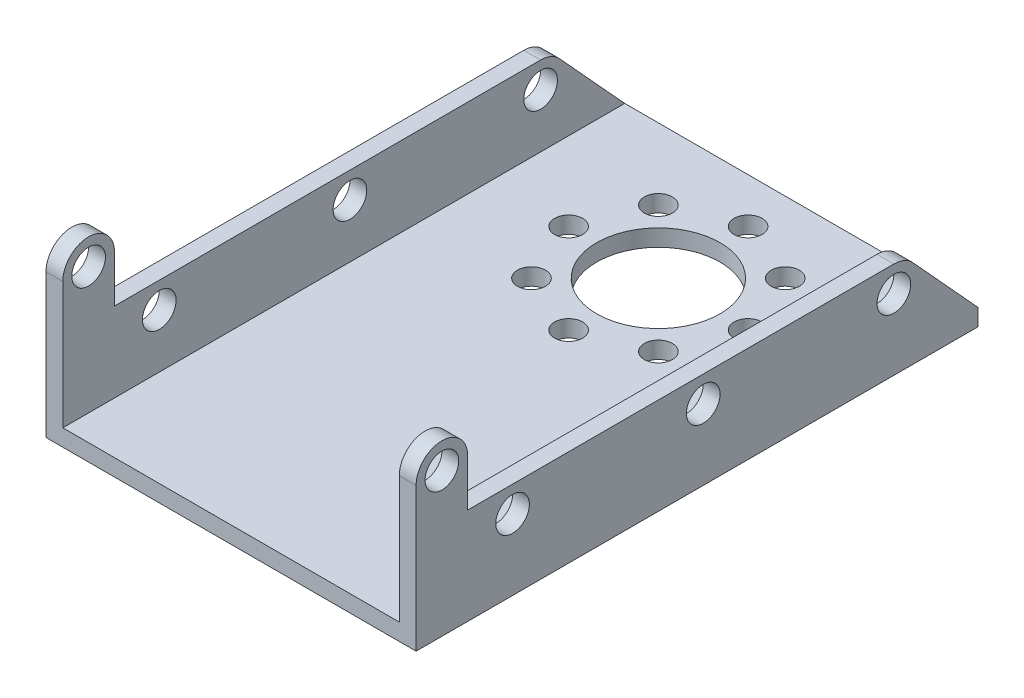
ISO-10303-21;
HEADER;
FILE_DESCRIPTION(('STEP AP214'),'2;1');
FILE_NAME('part.step','',(''),(''),'','','');
FILE_SCHEMA(('AUTOMOTIVE_DESIGN { 1 0 10303 214 1 1 1 1 }'));
ENDSEC;
DATA;
#1=APPLICATION_CONTEXT('core data for automotive mechanical design processes');
#2=APPLICATION_PROTOCOL_DEFINITION('international standard','automotive_design',2000,#1);
#3=PRODUCT_CONTEXT('',#1,'mechanical');
#4=PRODUCT('Part','Part','',(#3));
#5=PRODUCT_RELATED_PRODUCT_CATEGORY('part','',(#4));
#6=PRODUCT_DEFINITION_FORMATION('','',#4);
#7=PRODUCT_DEFINITION_CONTEXT('part definition',#1,'design');
#8=PRODUCT_DEFINITION('design','',#6,#7);
#9=PRODUCT_DEFINITION_SHAPE('','',#8);
#10=(LENGTH_UNIT() NAMED_UNIT(*) SI_UNIT(.MILLI.,.METRE.));
#11=(NAMED_UNIT(*) PLANE_ANGLE_UNIT() SI_UNIT($,.RADIAN.));
#12=(NAMED_UNIT(*) SI_UNIT($,.STERADIAN.) SOLID_ANGLE_UNIT());
#13=UNCERTAINTY_MEASURE_WITH_UNIT(LENGTH_MEASURE(1.E-05),#10,'distance_accuracy_value','');
#14=(GEOMETRIC_REPRESENTATION_CONTEXT(3) GLOBAL_UNCERTAINTY_ASSIGNED_CONTEXT((#13)) GLOBAL_UNIT_ASSIGNED_CONTEXT((#10,
#11,#12)) REPRESENTATION_CONTEXT('',''));
#15=CARTESIAN_POINT('',(0.,0.,0.));
#16=DIRECTION('',(0.,0.,1.));
#17=DIRECTION('',(1.,0.,0.));
#18=AXIS2_PLACEMENT_3D('',#15,#16,#17);
#19=CARTESIAN_POINT('',(0.,1.5,0.));
#20=DIRECTION('',(0.,-1.,0.));
#21=DIRECTION('',(0.,0.,-1.));
#22=AXIS2_PLACEMENT_3D('',#19,#20,#21);
#23=PLANE('',#22);
#24=DIRECTION('',(0.,0.,1.));
#25=VECTOR('',#24,1.);
#26=CARTESIAN_POINT('',(-15.,1.5,25.6));
#27=LINE('',#26,#25);
#28=CARTESIAN_POINT('',(-15.,1.5,-24.5));
#29=VERTEX_POINT('',#28);
#30=CARTESIAN_POINT('',(-15.,1.5,25.6));
#31=VERTEX_POINT('',#30);
#32=EDGE_CURVE('E417',#29,#31,#27,.T.);
#33=ORIENTED_EDGE('',*,*,#32,.T.);
#34=DIRECTION('',(1.,0.,0.));
#35=VECTOR('',#34,1.);
#36=CARTESIAN_POINT('',(15.,1.5,25.6));
#37=LINE('',#36,#35);
#38=CARTESIAN_POINT('',(15.,1.5,25.6));
#39=VERTEX_POINT('',#38);
#40=EDGE_CURVE('E421',#31,#39,#37,.T.);
#41=ORIENTED_EDGE('',*,*,#40,.T.);
#42=DIRECTION('',(0.,0.,-1.));
#43=VECTOR('',#42,1.);
#44=CARTESIAN_POINT('',(15.,1.5,-24.5));
#45=LINE('',#44,#43);
#46=CARTESIAN_POINT('',(15.,1.5,-24.5));
#47=VERTEX_POINT('',#46);
#48=EDGE_CURVE('E55',#39,#47,#45,.T.);
#49=ORIENTED_EDGE('',*,*,#48,.T.);
#50=DIRECTION('',(-1.,0.,0.));
#51=VECTOR('',#50,1.);
#52=CARTESIAN_POINT('',(-15.,1.5,-24.5));
#53=LINE('',#52,#51);
#54=EDGE_CURVE('E11',#47,#29,#53,.T.);
#55=ORIENTED_EDGE('',*,*,#54,.T.);
#56=EDGE_LOOP('',(#33,#41,#49,#55));
#57=FACE_BOUND('',#56,.T.);
#58=CARTESIAN_POINT('',(-8.,1.5,-12.5));
#59=DIRECTION('',(0.,1.,0.));
#60=DIRECTION('',(0.,0.,1.));
#61=AXIS2_PLACEMENT_3D('',#58,#59,#60);
#62=CIRCLE('',#61,1.25);
#63=CARTESIAN_POINT('',(-8.,1.5,-11.25));
#64=VERTEX_POINT('',#63);
#65=EDGE_CURVE('E409',#64,#64,#62,.T.);
#66=ORIENTED_EDGE('',*,*,#65,.F.);
#67=EDGE_LOOP('',(#66));
#68=FACE_BOUND('',#67,.T.);
#69=CARTESIAN_POINT('',(-5.65685424949237,1.5,-18.1568542494924));
#70=DIRECTION('',(0.,1.,0.));
#71=DIRECTION('',(0.,0.,1.));
#72=AXIS2_PLACEMENT_3D('',#69,#70,#71);
#73=CIRCLE('',#72,1.25);
#74=CARTESIAN_POINT('',(-5.65685424949237,1.5,-16.9068542494924));
#75=VERTEX_POINT('',#74);
#76=EDGE_CURVE('E401',#75,#75,#73,.T.);
#77=ORIENTED_EDGE('',*,*,#76,.F.);
#78=EDGE_LOOP('',(#77));
#79=FACE_BOUND('',#78,.T.);
#80=CARTESIAN_POINT('',(0.,1.5,-20.5));
#81=DIRECTION('',(0.,1.,0.));
#82=DIRECTION('',(0.,0.,1.));
#83=AXIS2_PLACEMENT_3D('',#80,#81,#82);
#84=CIRCLE('',#83,1.25);
#85=CARTESIAN_POINT('',(0.,1.5,-19.25));
#86=VERTEX_POINT('',#85);
#87=EDGE_CURVE('E393',#86,#86,#84,.T.);
#88=ORIENTED_EDGE('',*,*,#87,.F.);
#89=EDGE_LOOP('',(#88));
#90=FACE_BOUND('',#89,.T.);
#91=CARTESIAN_POINT('',(5.65685424949241,1.5,-18.1568542494924));
#92=DIRECTION('',(0.,1.,0.));
#93=DIRECTION('',(0.,0.,1.));
#94=AXIS2_PLACEMENT_3D('',#91,#92,#93);
#95=CIRCLE('',#94,1.25);
#96=CARTESIAN_POINT('',(5.65685424949241,1.5,-16.9068542494924));
#97=VERTEX_POINT('',#96);
#98=EDGE_CURVE('E385',#97,#97,#95,.T.);
#99=ORIENTED_EDGE('',*,*,#98,.F.);
#100=EDGE_LOOP('',(#99));
#101=FACE_BOUND('',#100,.T.);
#102=CARTESIAN_POINT('',(8.,1.5,-12.4999999999999));
#103=DIRECTION('',(0.,1.,0.));
#104=DIRECTION('',(0.,0.,1.));
#105=AXIS2_PLACEMENT_3D('',#102,#103,#104);
#106=CIRCLE('',#105,1.25);
#107=CARTESIAN_POINT('',(8.,1.5,-11.2499999999999));
#108=VERTEX_POINT('',#107);
#109=EDGE_CURVE('E377',#108,#108,#106,.T.);
#110=ORIENTED_EDGE('',*,*,#109,.F.);
#111=EDGE_LOOP('',(#110));
#112=FACE_BOUND('',#111,.T.);
#113=CARTESIAN_POINT('',(5.65685424949233,1.5,-6.84314575050757));
#114=DIRECTION('',(0.,1.,0.));
#115=DIRECTION('',(0.,0.,1.));
#116=AXIS2_PLACEMENT_3D('',#113,#114,#115);
#117=CIRCLE('',#116,1.25);
#118=CARTESIAN_POINT('',(5.65685424949233,1.5,-5.59314575050757));
#119=VERTEX_POINT('',#118);
#120=EDGE_CURVE('E369',#119,#119,#117,.T.);
#121=ORIENTED_EDGE('',*,*,#120,.F.);
#122=EDGE_LOOP('',(#121));
#123=FACE_BOUND('',#122,.T.);
#124=CARTESIAN_POINT('',(0.,1.5,-4.5));
#125=DIRECTION('',(0.,1.,0.));
#126=DIRECTION('',(0.,0.,1.));
#127=AXIS2_PLACEMENT_3D('',#124,#125,#126);
#128=CIRCLE('',#127,1.25);
#129=CARTESIAN_POINT('',(0.,1.5,-3.25));
#130=VERTEX_POINT('',#129);
#131=EDGE_CURVE('E361',#130,#130,#128,.T.);
#132=ORIENTED_EDGE('',*,*,#131,.F.);
#133=EDGE_LOOP('',(#132));
#134=FACE_BOUND('',#133,.T.);
#135=CARTESIAN_POINT('',(-5.65685424949245,1.5,-6.84314575050769));
#136=DIRECTION('',(0.,1.,0.));
#137=DIRECTION('',(0.,0.,1.));
#138=AXIS2_PLACEMENT_3D('',#135,#136,#137);
#139=CIRCLE('',#138,1.25);
#140=CARTESIAN_POINT('',(-5.65685424949245,1.5,-5.59314575050769));
#141=VERTEX_POINT('',#140);
#142=EDGE_CURVE('E353',#141,#141,#139,.T.);
#143=ORIENTED_EDGE('',*,*,#142,.F.);
#144=EDGE_LOOP('',(#143));
#145=FACE_BOUND('',#144,.T.);
#146=CARTESIAN_POINT('',(0.,1.5,-12.5));
#147=DIRECTION('',(0.,1.,0.));
#148=DIRECTION('',(0.,0.,1.));
#149=AXIS2_PLACEMENT_3D('',#146,#147,#148);
#150=CIRCLE('',#149,5.5);
#151=CARTESIAN_POINT('',(0.,1.5,-7.));
#152=VERTEX_POINT('',#151);
#153=EDGE_CURVE('E345',#152,#152,#150,.T.);
#154=ORIENTED_EDGE('',*,*,#153,.F.);
#155=EDGE_LOOP('',(#154));
#156=FACE_BOUND('',#155,.T.);
#157=ADVANCED_FACE('F45',(#57,#68,#79,#90,#101,#112,#123,#134,#145,#156),#23,.F.);
#158=CARTESIAN_POINT('',(0.,0.,0.));
#159=DIRECTION('',(0.,-1.,0.));
#160=DIRECTION('',(0.,0.,-1.));
#161=AXIS2_PLACEMENT_3D('',#158,#159,#160);
#162=PLANE('',#161);
#163=CARTESIAN_POINT('',(-5.65685424949245,0.,-6.84314575050769));
#164=DIRECTION('',(0.,1.,0.));
#165=DIRECTION('',(0.,0.,1.));
#166=AXIS2_PLACEMENT_3D('',#163,#164,#165);
#167=CIRCLE('',#166,1.25);
#168=CARTESIAN_POINT('',(-5.65685424949245,0.,-5.59314575050769));
#169=VERTEX_POINT('',#168);
#170=EDGE_CURVE('E349',#169,#169,#167,.T.);
#171=ORIENTED_EDGE('',*,*,#170,.T.);
#172=EDGE_LOOP('',(#171));
#173=FACE_BOUND('',#172,.T.);
#174=CARTESIAN_POINT('',(5.65685424949233,0.,-6.84314575050757));
#175=DIRECTION('',(0.,1.,0.));
#176=DIRECTION('',(0.,0.,1.));
#177=AXIS2_PLACEMENT_3D('',#174,#175,#176);
#178=CIRCLE('',#177,1.25);
#179=CARTESIAN_POINT('',(5.65685424949233,0.,-5.59314575050757));
#180=VERTEX_POINT('',#179);
#181=EDGE_CURVE('E365',#180,#180,#178,.T.);
#182=ORIENTED_EDGE('',*,*,#181,.T.);
#183=EDGE_LOOP('',(#182));
#184=FACE_BOUND('',#183,.T.);
#185=CARTESIAN_POINT('',(5.65685424949241,0.,-18.1568542494924));
#186=DIRECTION('',(0.,1.,0.));
#187=DIRECTION('',(0.,0.,1.));
#188=AXIS2_PLACEMENT_3D('',#185,#186,#187);
#189=CIRCLE('',#188,1.25);
#190=CARTESIAN_POINT('',(5.65685424949241,0.,-16.9068542494924));
#191=VERTEX_POINT('',#190);
#192=EDGE_CURVE('E381',#191,#191,#189,.T.);
#193=ORIENTED_EDGE('',*,*,#192,.T.);
#194=EDGE_LOOP('',(#193));
#195=FACE_BOUND('',#194,.T.);
#196=CARTESIAN_POINT('',(-5.65685424949237,0.,-18.1568542494924));
#197=DIRECTION('',(0.,1.,0.));
#198=DIRECTION('',(0.,0.,1.));
#199=AXIS2_PLACEMENT_3D('',#196,#197,#198);
#200=CIRCLE('',#199,1.25);
#201=CARTESIAN_POINT('',(-5.65685424949237,0.,-16.9068542494924));
#202=VERTEX_POINT('',#201);
#203=EDGE_CURVE('E397',#202,#202,#200,.T.);
#204=ORIENTED_EDGE('',*,*,#203,.T.);
#205=EDGE_LOOP('',(#204));
#206=FACE_BOUND('',#205,.T.);
#207=DIRECTION('',(1.,0.,0.));
#208=VECTOR('',#207,1.);
#209=CARTESIAN_POINT('',(15.,0.,25.6));
#210=LINE('',#209,#208);
#211=CARTESIAN_POINT('',(-16.5,0.,25.6));
#212=VERTEX_POINT('',#211);
#213=CARTESIAN_POINT('',(16.5,0.,25.6));
#214=VERTEX_POINT('',#213);
#215=EDGE_CURVE('E413',#212,#214,#210,.T.);
#216=ORIENTED_EDGE('',*,*,#215,.F.);
#217=DIRECTION('',(0.,0.,-1.));
#218=VECTOR('',#217,1.);
#219=CARTESIAN_POINT('',(-16.5,0.,25.6));
#220=LINE('',#219,#218);
#221=CARTESIAN_POINT('',(-16.5,0.,-24.5));
#222=VERTEX_POINT('',#221);
#223=EDGE_CURVE('E208',#212,#222,#220,.T.);
#224=ORIENTED_EDGE('',*,*,#223,.T.);
#225=DIRECTION('',(-1.,0.,0.));
#226=VECTOR('',#225,1.);
#227=CARTESIAN_POINT('',(-15.,0.,-24.5));
#228=LINE('',#227,#226);
#229=CARTESIAN_POINT('',(16.5,0.,-24.5));
#230=VERTEX_POINT('',#229);
#231=EDGE_CURVE('E49',#230,#222,#228,.T.);
#232=ORIENTED_EDGE('',*,*,#231,.F.);
#233=DIRECTION('',(0.,0.,-1.));
#234=VECTOR('',#233,1.);
#235=CARTESIAN_POINT('',(16.5,0.,-24.5));
#236=LINE('',#235,#234);
#237=EDGE_CURVE('E298',#214,#230,#236,.T.);
#238=ORIENTED_EDGE('',*,*,#237,.F.);
#239=EDGE_LOOP('',(#216,#224,#232,#238));
#240=FACE_BOUND('',#239,.T.);
#241=CARTESIAN_POINT('',(-8.,0.,-12.5));
#242=DIRECTION('',(0.,1.,0.));
#243=DIRECTION('',(0.,0.,1.));
#244=AXIS2_PLACEMENT_3D('',#241,#242,#243);
#245=CIRCLE('',#244,1.25);
#246=CARTESIAN_POINT('',(-8.,0.,-11.25));
#247=VERTEX_POINT('',#246);
#248=EDGE_CURVE('E405',#247,#247,#245,.T.);
#249=ORIENTED_EDGE('',*,*,#248,.T.);
#250=EDGE_LOOP('',(#249));
#251=FACE_BOUND('',#250,.T.);
#252=CARTESIAN_POINT('',(0.,0.,-20.5));
#253=DIRECTION('',(0.,1.,0.));
#254=DIRECTION('',(0.,0.,1.));
#255=AXIS2_PLACEMENT_3D('',#252,#253,#254);
#256=CIRCLE('',#255,1.25);
#257=CARTESIAN_POINT('',(0.,0.,-19.25));
#258=VERTEX_POINT('',#257);
#259=EDGE_CURVE('E389',#258,#258,#256,.T.);
#260=ORIENTED_EDGE('',*,*,#259,.T.);
#261=EDGE_LOOP('',(#260));
#262=FACE_BOUND('',#261,.T.);
#263=CARTESIAN_POINT('',(8.,0.,-12.4999999999999));
#264=DIRECTION('',(0.,1.,0.));
#265=DIRECTION('',(0.,0.,1.));
#266=AXIS2_PLACEMENT_3D('',#263,#264,#265);
#267=CIRCLE('',#266,1.25);
#268=CARTESIAN_POINT('',(8.,0.,-11.2499999999999));
#269=VERTEX_POINT('',#268);
#270=EDGE_CURVE('E373',#269,#269,#267,.T.);
#271=ORIENTED_EDGE('',*,*,#270,.T.);
#272=EDGE_LOOP('',(#271));
#273=FACE_BOUND('',#272,.T.);
#274=CARTESIAN_POINT('',(0.,0.,-4.5));
#275=DIRECTION('',(0.,1.,0.));
#276=DIRECTION('',(0.,0.,1.));
#277=AXIS2_PLACEMENT_3D('',#274,#275,#276);
#278=CIRCLE('',#277,1.25);
#279=CARTESIAN_POINT('',(0.,0.,-3.25));
#280=VERTEX_POINT('',#279);
#281=EDGE_CURVE('E357',#280,#280,#278,.T.);
#282=ORIENTED_EDGE('',*,*,#281,.T.);
#283=EDGE_LOOP('',(#282));
#284=FACE_BOUND('',#283,.T.);
#285=CARTESIAN_POINT('',(0.,0.,-12.5));
#286=DIRECTION('',(0.,1.,0.));
#287=DIRECTION('',(0.,0.,1.));
#288=AXIS2_PLACEMENT_3D('',#285,#286,#287);
#289=CIRCLE('',#288,5.5);
#290=CARTESIAN_POINT('',(0.,0.,-7.));
#291=VERTEX_POINT('',#290);
#292=EDGE_CURVE('E344',#291,#291,#289,.T.);
#293=ORIENTED_EDGE('',*,*,#292,.T.);
#294=EDGE_LOOP('',(#293));
#295=FACE_BOUND('',#294,.T.);
#296=ADVANCED_FACE('F438',(#173,#184,#195,#206,#240,#251,#262,#273,#284,#295),#162,.T.);
#297=CARTESIAN_POINT('',(15.,1.5,25.6));
#298=DIRECTION('',(0.,0.,-1.));
#299=DIRECTION('',(-1.,0.,0.));
#300=AXIS2_PLACEMENT_3D('',#297,#298,#299);
#301=PLANE('',#300);
#302=ORIENTED_EDGE('',*,*,#215,.T.);
#303=DIRECTION('',(0.,-1.,0.));
#304=VECTOR('',#303,1.);
#305=CARTESIAN_POINT('',(16.5,1.5,25.6));
#306=LINE('',#305,#304);
#307=CARTESIAN_POINT('',(16.5,12.8,25.6));
#308=VERTEX_POINT('',#307);
#309=EDGE_CURVE('E294',#308,#214,#306,.T.);
#310=ORIENTED_EDGE('',*,*,#309,.F.);
#311=DIRECTION('',(-1.,0.,0.));
#312=VECTOR('',#311,1.);
#313=CARTESIAN_POINT('',(16.5,12.8,25.6));
#314=LINE('',#313,#312);
#315=CARTESIAN_POINT('',(15.,12.8,25.6));
#316=VERTEX_POINT('',#315);
#317=EDGE_CURVE('E327',#308,#316,#314,.T.);
#318=ORIENTED_EDGE('',*,*,#317,.T.);
#319=DIRECTION('',(0.,-1.,0.));
#320=VECTOR('',#319,1.);
#321=CARTESIAN_POINT('',(15.,1.5,25.6));
#322=LINE('',#321,#320);
#323=EDGE_CURVE('E280',#316,#39,#322,.T.);
#324=ORIENTED_EDGE('',*,*,#323,.T.);
#325=ORIENTED_EDGE('',*,*,#40,.F.);
#326=DIRECTION('',(0.,-1.,0.));
#327=VECTOR('',#326,1.);
#328=CARTESIAN_POINT('',(-15.,1.5,25.6));
#329=LINE('',#328,#327);
#330=CARTESIAN_POINT('',(-15.,12.8,25.6));
#331=VERTEX_POINT('',#330);
#332=EDGE_CURVE('E71',#331,#31,#329,.T.);
#333=ORIENTED_EDGE('',*,*,#332,.F.);
#334=DIRECTION('',(1.,0.,0.));
#335=VECTOR('',#334,1.);
#336=CARTESIAN_POINT('',(-16.5,12.8,25.6));
#337=LINE('',#336,#335);
#338=CARTESIAN_POINT('',(-16.5,12.8,25.6));
#339=VERTEX_POINT('',#338);
#340=EDGE_CURVE('E233',#339,#331,#337,.T.);
#341=ORIENTED_EDGE('',*,*,#340,.F.);
#342=DIRECTION('',(0.,-1.,0.));
#343=VECTOR('',#342,1.);
#344=CARTESIAN_POINT('',(-16.5,1.5,25.6));
#345=LINE('',#344,#343);
#346=EDGE_CURVE('E204',#339,#212,#345,.T.);
#347=ORIENTED_EDGE('',*,*,#346,.T.);
#348=EDGE_LOOP('',(#302,#310,#318,#324,#325,#333,#341,#347));
#349=FACE_BOUND('',#348,.T.);
#350=ADVANCED_FACE('F47',(#349),#301,.F.);
#351=CARTESIAN_POINT('',(-15.,1.5,-24.5));
#352=DIRECTION('',(0.,0.,1.));
#353=DIRECTION('',(1.,0.,0.));
#354=AXIS2_PLACEMENT_3D('',#351,#352,#353);
#355=PLANE('',#354);
#356=ORIENTED_EDGE('',*,*,#231,.T.);
#357=DIRECTION('',(0.,1.,0.));
#358=VECTOR('',#357,1.);
#359=CARTESIAN_POINT('',(-16.5,1.5,-24.5));
#360=LINE('',#359,#358);
#361=CARTESIAN_POINT('',(-16.5,1.5,-24.5));
#362=VERTEX_POINT('',#361);
#363=EDGE_CURVE('E168',#222,#362,#360,.T.);
#364=ORIENTED_EDGE('',*,*,#363,.T.);
#365=DIRECTION('',(1.,0.,0.));
#366=VECTOR('',#365,1.);
#367=CARTESIAN_POINT('',(-16.5,1.5,-24.5));
#368=LINE('',#367,#366);
#369=EDGE_CURVE('E184',#362,#29,#368,.T.);
#370=ORIENTED_EDGE('',*,*,#369,.T.);
#371=ORIENTED_EDGE('',*,*,#54,.F.);
#372=DIRECTION('',(-1.,0.,0.));
#373=VECTOR('',#372,1.);
#374=CARTESIAN_POINT('',(16.5,1.5,-24.5));
#375=LINE('',#374,#373);
#376=CARTESIAN_POINT('',(16.5,1.5,-24.5));
#377=VERTEX_POINT('',#376);
#378=EDGE_CURVE('E305',#377,#47,#375,.T.);
#379=ORIENTED_EDGE('',*,*,#378,.F.);
#380=DIRECTION('',(0.,1.,0.));
#381=VECTOR('',#380,1.);
#382=CARTESIAN_POINT('',(16.5,1.5,-24.5));
#383=LINE('',#382,#381);
#384=EDGE_CURVE('E302',#230,#377,#383,.T.);
#385=ORIENTED_EDGE('',*,*,#384,.F.);
#386=EDGE_LOOP('',(#356,#364,#370,#371,#379,#385));
#387=FACE_BOUND('',#386,.T.);
#388=ADVANCED_FACE('F433',(#387),#355,.F.);
#389=CARTESIAN_POINT('',(-8.,1.5,-12.5));
#390=DIRECTION('',(0.,-1.,0.));
#391=DIRECTION('',(0.,0.,-1.));
#392=AXIS2_PLACEMENT_3D('',#389,#390,#391);
#393=CYLINDRICAL_SURFACE('',#392,1.25);
#394=ORIENTED_EDGE('',*,*,#65,.T.);
#395=EDGE_LOOP('',(#394));
#396=FACE_BOUND('',#395,.T.);
#397=ORIENTED_EDGE('',*,*,#248,.F.);
#398=EDGE_LOOP('',(#397));
#399=FACE_BOUND('',#398,.T.);
#400=ADVANCED_FACE('F497',(#396,#399),#393,.F.);
#401=CARTESIAN_POINT('',(-5.65685424949237,1.5,-18.1568542494924));
#402=DIRECTION('',(0.,-1.,0.));
#403=DIRECTION('',(0.,0.,-1.));
#404=AXIS2_PLACEMENT_3D('',#401,#402,#403);
#405=CYLINDRICAL_SURFACE('',#404,1.25);
#406=ORIENTED_EDGE('',*,*,#76,.T.);
#407=EDGE_LOOP('',(#406));
#408=FACE_BOUND('',#407,.T.);
#409=ORIENTED_EDGE('',*,*,#203,.F.);
#410=EDGE_LOOP('',(#409));
#411=FACE_BOUND('',#410,.T.);
#412=ADVANCED_FACE('F505',(#408,#411),#405,.F.);
#413=CARTESIAN_POINT('',(0.,1.5,-20.5));
#414=DIRECTION('',(0.,-1.,0.));
#415=DIRECTION('',(0.,0.,-1.));
#416=AXIS2_PLACEMENT_3D('',#413,#414,#415);
#417=CYLINDRICAL_SURFACE('',#416,1.25);
#418=ORIENTED_EDGE('',*,*,#87,.T.);
#419=EDGE_LOOP('',(#418));
#420=FACE_BOUND('',#419,.T.);
#421=ORIENTED_EDGE('',*,*,#259,.F.);
#422=EDGE_LOOP('',(#421));
#423=FACE_BOUND('',#422,.T.);
#424=ADVANCED_FACE('F839',(#420,#423),#417,.F.);
#425=CARTESIAN_POINT('',(5.65685424949241,1.5,-18.1568542494924));
#426=DIRECTION('',(0.,-1.,0.));
#427=DIRECTION('',(0.,0.,-1.));
#428=AXIS2_PLACEMENT_3D('',#425,#426,#427);
#429=CYLINDRICAL_SURFACE('',#428,1.25);
#430=ORIENTED_EDGE('',*,*,#98,.T.);
#431=EDGE_LOOP('',(#430));
#432=FACE_BOUND('',#431,.T.);
#433=ORIENTED_EDGE('',*,*,#192,.F.);
#434=EDGE_LOOP('',(#433));
#435=FACE_BOUND('',#434,.T.);
#436=ADVANCED_FACE('F830',(#432,#435),#429,.F.);
#437=CARTESIAN_POINT('',(8.,1.5,-12.4999999999999));
#438=DIRECTION('',(0.,-1.,0.));
#439=DIRECTION('',(0.,0.,-1.));
#440=AXIS2_PLACEMENT_3D('',#437,#438,#439);
#441=CYLINDRICAL_SURFACE('',#440,1.25);
#442=ORIENTED_EDGE('',*,*,#109,.T.);
#443=EDGE_LOOP('',(#442));
#444=FACE_BOUND('',#443,.T.);
#445=ORIENTED_EDGE('',*,*,#270,.F.);
#446=EDGE_LOOP('',(#445));
#447=FACE_BOUND('',#446,.T.);
#448=ADVANCED_FACE('F821',(#444,#447),#441,.F.);
#449=CARTESIAN_POINT('',(5.65685424949233,1.5,-6.84314575050757));
#450=DIRECTION('',(0.,-1.,0.));
#451=DIRECTION('',(0.,0.,-1.));
#452=AXIS2_PLACEMENT_3D('',#449,#450,#451);
#453=CYLINDRICAL_SURFACE('',#452,1.25);
#454=ORIENTED_EDGE('',*,*,#120,.T.);
#455=EDGE_LOOP('',(#454));
#456=FACE_BOUND('',#455,.T.);
#457=ORIENTED_EDGE('',*,*,#181,.F.);
#458=EDGE_LOOP('',(#457));
#459=FACE_BOUND('',#458,.T.);
#460=ADVANCED_FACE('F812',(#456,#459),#453,.F.);
#461=CARTESIAN_POINT('',(0.,1.5,-4.5));
#462=DIRECTION('',(0.,-1.,0.));
#463=DIRECTION('',(0.,0.,-1.));
#464=AXIS2_PLACEMENT_3D('',#461,#462,#463);
#465=CYLINDRICAL_SURFACE('',#464,1.25);
#466=ORIENTED_EDGE('',*,*,#131,.T.);
#467=EDGE_LOOP('',(#466));
#468=FACE_BOUND('',#467,.T.);
#469=ORIENTED_EDGE('',*,*,#281,.F.);
#470=EDGE_LOOP('',(#469));
#471=FACE_BOUND('',#470,.T.);
#472=ADVANCED_FACE('F803',(#468,#471),#465,.F.);
#473=CARTESIAN_POINT('',(-5.65685424949245,1.5,-6.84314575050769));
#474=DIRECTION('',(0.,-1.,0.));
#475=DIRECTION('',(0.,0.,-1.));
#476=AXIS2_PLACEMENT_3D('',#473,#474,#475);
#477=CYLINDRICAL_SURFACE('',#476,1.25);
#478=ORIENTED_EDGE('',*,*,#142,.T.);
#479=EDGE_LOOP('',(#478));
#480=FACE_BOUND('',#479,.T.);
#481=ORIENTED_EDGE('',*,*,#170,.F.);
#482=EDGE_LOOP('',(#481));
#483=FACE_BOUND('',#482,.T.);
#484=ADVANCED_FACE('F795',(#480,#483),#477,.F.);
#485=CARTESIAN_POINT('',(0.,1.5,-12.5));
#486=DIRECTION('',(0.,-1.,0.));
#487=DIRECTION('',(0.,0.,-1.));
#488=AXIS2_PLACEMENT_3D('',#485,#486,#487);
#489=CYLINDRICAL_SURFACE('',#488,5.5);
#490=ORIENTED_EDGE('',*,*,#153,.T.);
#491=EDGE_LOOP('',(#490));
#492=FACE_BOUND('',#491,.T.);
#493=ORIENTED_EDGE('',*,*,#292,.F.);
#494=EDGE_LOOP('',(#493));
#495=FACE_BOUND('',#494,.T.);
#496=ADVANCED_FACE('F553',(#492,#495),#489,.F.);
#497=CARTESIAN_POINT('',(15.,6.30000000000001,-16.99999989));
#498=DIRECTION('',(-1.,0.,0.));
#499=DIRECTION('',(0.,0.,1.));
#500=AXIS2_PLACEMENT_3D('',#497,#498,#499);
#501=PLANE('',#500);
#502=CARTESIAN_POINT('',(15.,12.8,23.3));
#503=DIRECTION('',(-1.,0.,0.));
#504=DIRECTION('',(0.,0.,1.));
#505=AXIS2_PLACEMENT_3D('',#502,#503,#504);
#506=CIRCLE('',#505,1.5);
#507=CARTESIAN_POINT('',(15.,12.8,24.8));
#508=VERTEX_POINT('',#507);
#509=EDGE_CURVE('E265',#508,#508,#506,.T.);
#510=ORIENTED_EDGE('',*,*,#509,.F.);
#511=EDGE_LOOP('',(#510));
#512=FACE_BOUND('',#511,.T.);
#513=CARTESIAN_POINT('',(15.,6.30000000000001,17.00000011));
#514=DIRECTION('',(-1.,0.,0.));
#515=DIRECTION('',(0.,0.,1.));
#516=AXIS2_PLACEMENT_3D('',#513,#514,#515);
#517=CIRCLE('',#516,1.5);
#518=CARTESIAN_POINT('',(15.,6.30000000000001,18.50000011));
#519=VERTEX_POINT('',#518);
#520=EDGE_CURVE('E257',#519,#519,#517,.T.);
#521=ORIENTED_EDGE('',*,*,#520,.F.);
#522=EDGE_LOOP('',(#521));
#523=FACE_BOUND('',#522,.T.);
#524=CARTESIAN_POINT('',(15.,6.30000000000001,1.099999986931E-07));
#525=DIRECTION('',(-1.,0.,0.));
#526=DIRECTION('',(0.,0.,1.));
#527=AXIS2_PLACEMENT_3D('',#524,#525,#526);
#528=CIRCLE('',#527,1.5);
#529=CARTESIAN_POINT('',(15.,6.30000000000001,1.50000011));
#530=VERTEX_POINT('',#529);
#531=EDGE_CURVE('E249',#530,#530,#528,.T.);
#532=ORIENTED_EDGE('',*,*,#531,.F.);
#533=EDGE_LOOP('',(#532));
#534=FACE_BOUND('',#533,.T.);
#535=CARTESIAN_POINT('',(15.,6.30000000000001,-16.99999989));
#536=DIRECTION('',(-1.,0.,0.));
#537=DIRECTION('',(0.,0.,1.));
#538=AXIS2_PLACEMENT_3D('',#535,#536,#537);
#539=CIRCLE('',#538,1.5);
#540=CARTESIAN_POINT('',(15.,6.30000000000001,-15.49999989));
#541=VERTEX_POINT('',#540);
#542=EDGE_CURVE('E232',#541,#541,#539,.T.);
#543=ORIENTED_EDGE('',*,*,#542,.F.);
#544=EDGE_LOOP('',(#543));
#545=FACE_BOUND('',#544,.T.);
#546=ORIENTED_EDGE('',*,*,#48,.F.);
#547=ORIENTED_EDGE('',*,*,#323,.F.);
#548=CARTESIAN_POINT('',(15.,12.8,23.3));
#549=DIRECTION('',(-1.,0.,0.));
#550=DIRECTION('',(0.,0.,1.));
#551=AXIS2_PLACEMENT_3D('',#548,#549,#550);
#552=CIRCLE('',#551,2.30000000000001);
#553=CARTESIAN_POINT('',(15.,12.8,21.));
#554=VERTEX_POINT('',#553);
#555=EDGE_CURVE('E318',#316,#554,#552,.T.);
#556=ORIENTED_EDGE('',*,*,#555,.T.);
#557=DIRECTION('',(0.,1.,0.));
#558=VECTOR('',#557,1.);
#559=CARTESIAN_POINT('',(15.,1.5,21.));
#560=LINE('',#559,#558);
#561=CARTESIAN_POINT('',(15.,8.6,21.));
#562=VERTEX_POINT('',#561);
#563=EDGE_CURVE('E314',#562,#554,#560,.T.);
#564=ORIENTED_EDGE('',*,*,#563,.F.);
#565=DIRECTION('',(0.,0.,1.));
#566=VECTOR('',#565,1.);
#567=CARTESIAN_POINT('',(15.,8.60000000000001,-24.5));
#568=LINE('',#567,#566);
#569=CARTESIAN_POINT('',(15.,8.60000000000001,-16.99999989));
#570=VERTEX_POINT('',#569);
#571=EDGE_CURVE('E311',#570,#562,#568,.T.);
#572=ORIENTED_EDGE('',*,*,#571,.F.);
#573=CARTESIAN_POINT('',(15.,6.30000000000001,-16.99999989));
#574=DIRECTION('',(-1.,0.,0.));
#575=DIRECTION('',(0.,0.,1.));
#576=AXIS2_PLACEMENT_3D('',#573,#574,#575);
#577=CIRCLE('',#576,2.3);
#578=CARTESIAN_POINT('',(15.,7.85124368933877,-18.6981291596043));
#579=VERTEX_POINT('',#578);
#580=EDGE_CURVE('E308',#570,#579,#577,.T.);
#581=ORIENTED_EDGE('',*,*,#580,.T.);
#582=DIRECTION('',(0.,0.738317073740978,0.674453777973375));
#583=VECTOR('',#582,1.);
#584=CARTESIAN_POINT('',(15.,1.5,-24.5));
#585=LINE('',#584,#583);
#586=EDGE_CURVE('E63',#47,#579,#585,.T.);
#587=ORIENTED_EDGE('',*,*,#586,.F.);
#588=EDGE_LOOP('',(#546,#547,#556,#564,#572,#581,#587));
#589=FACE_BOUND('',#588,.T.);
#590=ADVANCED_FACE('F468',(#512,#523,#534,#545,#589),#501,.T.);
#591=CARTESIAN_POINT('',(16.5,1.5,-24.5));
#592=DIRECTION('',(0.,-0.674453777973375,0.738317073740978));
#593=DIRECTION('',(0.,-0.738317073740978,-0.674453777973375));
#594=AXIS2_PLACEMENT_3D('',#591,#592,#593);
#595=PLANE('',#594);
#596=ORIENTED_EDGE('',*,*,#586,.T.);
#597=DIRECTION('',(-1.,0.,0.));
#598=VECTOR('',#597,1.);
#599=CARTESIAN_POINT('',(16.5,7.85124368933877,-18.6981291596043));
#600=LINE('',#599,#598);
#601=CARTESIAN_POINT('',(16.5,7.85124368933877,-18.6981291596043));
#602=VERTEX_POINT('',#601);
#603=EDGE_CURVE('E341',#602,#579,#600,.T.);
#604=ORIENTED_EDGE('',*,*,#603,.F.);
#605=DIRECTION('',(0.,0.738317073740978,0.674453777973375));
#606=VECTOR('',#605,1.);
#607=CARTESIAN_POINT('',(16.5,1.5,-24.5));
#608=LINE('',#607,#606);
#609=EDGE_CURVE('E276',#377,#602,#608,.T.);
#610=ORIENTED_EDGE('',*,*,#609,.F.);
#611=ORIENTED_EDGE('',*,*,#378,.T.);
#612=EDGE_LOOP('',(#596,#604,#610,#611));
#613=FACE_BOUND('',#612,.T.);
#614=ADVANCED_FACE('F458',(#613),#595,.F.);
#615=CARTESIAN_POINT('',(16.5,6.30000000000001,-16.99999989));
#616=DIRECTION('',(-1.,0.,0.));
#617=DIRECTION('',(0.,0.,1.));
#618=AXIS2_PLACEMENT_3D('',#615,#616,#617);
#619=CYLINDRICAL_SURFACE('',#618,2.3);
#620=ORIENTED_EDGE('',*,*,#580,.F.);
#621=DIRECTION('',(-1.,0.,0.));
#622=VECTOR('',#621,1.);
#623=CARTESIAN_POINT('',(16.5,8.60000000000001,-16.99999989));
#624=LINE('',#623,#622);
#625=CARTESIAN_POINT('',(16.5,8.60000000000001,-16.99999989));
#626=VERTEX_POINT('',#625);
#627=EDGE_CURVE('E338',#626,#570,#624,.T.);
#628=ORIENTED_EDGE('',*,*,#627,.F.);
#629=CARTESIAN_POINT('',(16.5,6.30000000000001,-16.99999989));
#630=DIRECTION('',(-1.,0.,0.));
#631=DIRECTION('',(0.,0.,1.));
#632=AXIS2_PLACEMENT_3D('',#629,#630,#631);
#633=CIRCLE('',#632,2.3);
#634=EDGE_CURVE('E279',#626,#602,#633,.T.);
#635=ORIENTED_EDGE('',*,*,#634,.T.);
#636=ORIENTED_EDGE('',*,*,#603,.T.);
#637=EDGE_LOOP('',(#620,#628,#635,#636));
#638=FACE_BOUND('',#637,.T.);
#639=ADVANCED_FACE('F479',(#638),#619,.T.);
#640=CARTESIAN_POINT('',(16.5,8.60000000000001,-24.5));
#641=DIRECTION('',(0.,-1.,0.));
#642=DIRECTION('',(0.,0.,-1.));
#643=AXIS2_PLACEMENT_3D('',#640,#641,#642);
#644=PLANE('',#643);
#645=ORIENTED_EDGE('',*,*,#571,.T.);
#646=DIRECTION('',(-1.,0.,0.));
#647=VECTOR('',#646,1.);
#648=CARTESIAN_POINT('',(16.5,8.6,21.));
#649=LINE('',#648,#647);
#650=CARTESIAN_POINT('',(16.5,8.6,21.));
#651=VERTEX_POINT('',#650);
#652=EDGE_CURVE('E334',#651,#562,#649,.T.);
#653=ORIENTED_EDGE('',*,*,#652,.F.);
#654=DIRECTION('',(0.,0.,1.));
#655=VECTOR('',#654,1.);
#656=CARTESIAN_POINT('',(16.5,8.60000000000001,-24.5));
#657=LINE('',#656,#655);
#658=EDGE_CURVE('E284',#626,#651,#657,.T.);
#659=ORIENTED_EDGE('',*,*,#658,.F.);
#660=ORIENTED_EDGE('',*,*,#627,.T.);
#661=EDGE_LOOP('',(#645,#653,#659,#660));
#662=FACE_BOUND('',#661,.T.);
#663=ADVANCED_FACE('F477',(#662),#644,.F.);
#664=CARTESIAN_POINT('',(16.5,1.5,21.));
#665=DIRECTION('',(0.,0.,1.));
#666=DIRECTION('',(1.,0.,0.));
#667=AXIS2_PLACEMENT_3D('',#664,#665,#666);
#668=PLANE('',#667);
#669=ORIENTED_EDGE('',*,*,#563,.T.);
#670=DIRECTION('',(-1.,0.,0.));
#671=VECTOR('',#670,1.);
#672=CARTESIAN_POINT('',(16.5,12.8,21.));
#673=LINE('',#672,#671);
#674=CARTESIAN_POINT('',(16.5,12.8,21.));
#675=VERTEX_POINT('',#674);
#676=EDGE_CURVE('E331',#675,#554,#673,.T.);
#677=ORIENTED_EDGE('',*,*,#676,.F.);
#678=DIRECTION('',(0.,1.,0.));
#679=VECTOR('',#678,1.);
#680=CARTESIAN_POINT('',(16.5,1.5,21.));
#681=LINE('',#680,#679);
#682=EDGE_CURVE('E287',#651,#675,#681,.T.);
#683=ORIENTED_EDGE('',*,*,#682,.F.);
#684=ORIENTED_EDGE('',*,*,#652,.T.);
#685=EDGE_LOOP('',(#669,#677,#683,#684));
#686=FACE_BOUND('',#685,.T.);
#687=ADVANCED_FACE('F472',(#686),#668,.F.);
#688=CARTESIAN_POINT('',(16.5,12.8,23.3));
#689=DIRECTION('',(-1.,0.,0.));
#690=DIRECTION('',(0.,0.,1.));
#691=AXIS2_PLACEMENT_3D('',#688,#689,#690);
#692=CYLINDRICAL_SURFACE('',#691,2.30000000000001);
#693=ORIENTED_EDGE('',*,*,#555,.F.);
#694=ORIENTED_EDGE('',*,*,#317,.F.);
#695=CARTESIAN_POINT('',(16.5,12.8,23.3));
#696=DIRECTION('',(-1.,0.,0.));
#697=DIRECTION('',(0.,0.,1.));
#698=AXIS2_PLACEMENT_3D('',#695,#696,#697);
#699=CIRCLE('',#698,2.30000000000001);
#700=EDGE_CURVE('E290',#308,#675,#699,.T.);
#701=ORIENTED_EDGE('',*,*,#700,.T.);
#702=ORIENTED_EDGE('',*,*,#676,.T.);
#703=EDGE_LOOP('',(#693,#694,#701,#702));
#704=FACE_BOUND('',#703,.T.);
#705=ADVANCED_FACE('F465',(#704),#692,.T.);
#706=CARTESIAN_POINT('',(16.5,6.30000000000001,-16.99999989));
#707=DIRECTION('',(-1.,0.,0.));
#708=DIRECTION('',(0.,0.,1.));
#709=AXIS2_PLACEMENT_3D('',#706,#707,#708);
#710=PLANE('',#709);
#711=CARTESIAN_POINT('',(16.5,6.30000000000001,-16.99999989));
#712=DIRECTION('',(-1.,0.,0.));
#713=DIRECTION('',(0.,0.,1.));
#714=AXIS2_PLACEMENT_3D('',#711,#712,#713);
#715=CIRCLE('',#714,1.5);
#716=CARTESIAN_POINT('',(16.5,6.30000000000001,-15.49999989));
#717=VERTEX_POINT('',#716);
#718=EDGE_CURVE('E245',#717,#717,#715,.T.);
#719=ORIENTED_EDGE('',*,*,#718,.T.);
#720=EDGE_LOOP('',(#719));
#721=FACE_BOUND('',#720,.T.);
#722=CARTESIAN_POINT('',(16.5,6.30000000000001,1.099999986931E-07));
#723=DIRECTION('',(-1.,0.,0.));
#724=DIRECTION('',(0.,0.,1.));
#725=AXIS2_PLACEMENT_3D('',#722,#723,#724);
#726=CIRCLE('',#725,1.5);
#727=CARTESIAN_POINT('',(16.5,6.30000000000001,1.50000011));
#728=VERTEX_POINT('',#727);
#729=EDGE_CURVE('E253',#728,#728,#726,.T.);
#730=ORIENTED_EDGE('',*,*,#729,.T.);
#731=EDGE_LOOP('',(#730));
#732=FACE_BOUND('',#731,.T.);
#733=CARTESIAN_POINT('',(16.5,6.30000000000001,17.00000011));
#734=DIRECTION('',(-1.,0.,0.));
#735=DIRECTION('',(0.,0.,1.));
#736=AXIS2_PLACEMENT_3D('',#733,#734,#735);
#737=CIRCLE('',#736,1.5);
#738=CARTESIAN_POINT('',(16.5,6.30000000000001,18.50000011));
#739=VERTEX_POINT('',#738);
#740=EDGE_CURVE('E261',#739,#739,#737,.T.);
#741=ORIENTED_EDGE('',*,*,#740,.T.);
#742=EDGE_LOOP('',(#741));
#743=FACE_BOUND('',#742,.T.);
#744=CARTESIAN_POINT('',(16.5,12.8,23.3));
#745=DIRECTION('',(-1.,0.,0.));
#746=DIRECTION('',(0.,0.,1.));
#747=AXIS2_PLACEMENT_3D('',#744,#745,#746);
#748=CIRCLE('',#747,1.5);
#749=CARTESIAN_POINT('',(16.5,12.8,24.8));
#750=VERTEX_POINT('',#749);
#751=EDGE_CURVE('E269',#750,#750,#748,.T.);
#752=ORIENTED_EDGE('',*,*,#751,.T.);
#753=EDGE_LOOP('',(#752));
#754=FACE_BOUND('',#753,.T.);
#755=ORIENTED_EDGE('',*,*,#609,.T.);
#756=ORIENTED_EDGE('',*,*,#634,.F.);
#757=ORIENTED_EDGE('',*,*,#658,.T.);
#758=ORIENTED_EDGE('',*,*,#682,.T.);
#759=ORIENTED_EDGE('',*,*,#700,.F.);
#760=ORIENTED_EDGE('',*,*,#309,.T.);
#761=ORIENTED_EDGE('',*,*,#237,.T.);
#762=ORIENTED_EDGE('',*,*,#384,.T.);
#763=EDGE_LOOP('',(#755,#756,#757,#758,#759,#760,#761,#762));
#764=FACE_BOUND('',#763,.T.);
#765=ADVANCED_FACE('F461',(#721,#732,#743,#754,#764),#710,.F.);
#766=CARTESIAN_POINT('',(16.5,12.8,23.3));
#767=DIRECTION('',(-1.,0.,0.));
#768=DIRECTION('',(0.,0.,1.));
#769=AXIS2_PLACEMENT_3D('',#766,#767,#768);
#770=CYLINDRICAL_SURFACE('',#769,1.5);
#771=ORIENTED_EDGE('',*,*,#751,.F.);
#772=EDGE_LOOP('',(#771));
#773=FACE_BOUND('',#772,.T.);
#774=ORIENTED_EDGE('',*,*,#509,.T.);
#775=EDGE_LOOP('',(#774));
#776=FACE_BOUND('',#775,.T.);
#777=ADVANCED_FACE('F597',(#773,#776),#770,.F.);
#778=CARTESIAN_POINT('',(16.5,6.30000000000001,17.00000011));
#779=DIRECTION('',(-1.,0.,0.));
#780=DIRECTION('',(0.,0.,1.));
#781=AXIS2_PLACEMENT_3D('',#778,#779,#780);
#782=CYLINDRICAL_SURFACE('',#781,1.5);
#783=ORIENTED_EDGE('',*,*,#740,.F.);
#784=EDGE_LOOP('',(#783));
#785=FACE_BOUND('',#784,.T.);
#786=ORIENTED_EDGE('',*,*,#520,.T.);
#787=EDGE_LOOP('',(#786));
#788=FACE_BOUND('',#787,.T.);
#789=ADVANCED_FACE('F607',(#785,#788),#782,.F.);
#790=CARTESIAN_POINT('',(16.5,6.30000000000001,1.099999986931E-07));
#791=DIRECTION('',(-1.,0.,0.));
#792=DIRECTION('',(0.,0.,1.));
#793=AXIS2_PLACEMENT_3D('',#790,#791,#792);
#794=CYLINDRICAL_SURFACE('',#793,1.5);
#795=ORIENTED_EDGE('',*,*,#729,.F.);
#796=EDGE_LOOP('',(#795));
#797=FACE_BOUND('',#796,.T.);
#798=ORIENTED_EDGE('',*,*,#531,.T.);
#799=EDGE_LOOP('',(#798));
#800=FACE_BOUND('',#799,.T.);
#801=ADVANCED_FACE('F616',(#797,#800),#794,.F.);
#802=CARTESIAN_POINT('',(16.5,6.30000000000001,-16.99999989));
#803=DIRECTION('',(-1.,0.,0.));
#804=DIRECTION('',(0.,0.,1.));
#805=AXIS2_PLACEMENT_3D('',#802,#803,#804);
#806=CYLINDRICAL_SURFACE('',#805,1.5);
#807=ORIENTED_EDGE('',*,*,#718,.F.);
#808=EDGE_LOOP('',(#807));
#809=FACE_BOUND('',#808,.T.);
#810=ORIENTED_EDGE('',*,*,#542,.T.);
#811=EDGE_LOOP('',(#810));
#812=FACE_BOUND('',#811,.T.);
#813=ADVANCED_FACE('F523',(#809,#812),#806,.F.);
#814=CARTESIAN_POINT('',(-15.,6.30000000000001,-16.99999989));
#815=DIRECTION('',(1.,0.,0.));
#816=DIRECTION('',(0.,0.,-1.));
#817=AXIS2_PLACEMENT_3D('',#814,#815,#816);
#818=PLANE('',#817);
#819=CARTESIAN_POINT('',(-15.,12.8,23.3));
#820=DIRECTION('',(1.,0.,0.));
#821=DIRECTION('',(0.,0.,-1.));
#822=AXIS2_PLACEMENT_3D('',#819,#820,#821);
#823=CIRCLE('',#822,1.5);
#824=CARTESIAN_POINT('',(-15.,12.8,21.8));
#825=VERTEX_POINT('',#824);
#826=EDGE_CURVE('E191',#825,#825,#823,.T.);
#827=ORIENTED_EDGE('',*,*,#826,.F.);
#828=EDGE_LOOP('',(#827));
#829=FACE_BOUND('',#828,.T.);
#830=CARTESIAN_POINT('',(-15.,6.30000000000001,17.00000011));
#831=DIRECTION('',(1.,0.,0.));
#832=DIRECTION('',(0.,0.,-1.));
#833=AXIS2_PLACEMENT_3D('',#830,#831,#832);
#834=CIRCLE('',#833,1.5);
#835=CARTESIAN_POINT('',(-15.,6.30000000000001,15.50000011));
#836=VERTEX_POINT('',#835);
#837=EDGE_CURVE('E685',#836,#836,#834,.T.);
#838=ORIENTED_EDGE('',*,*,#837,.F.);
#839=EDGE_LOOP('',(#838));
#840=FACE_BOUND('',#839,.T.);
#841=CARTESIAN_POINT('',(-15.,6.30000000000001,1.099999986931E-07));
#842=DIRECTION('',(1.,0.,0.));
#843=DIRECTION('',(0.,0.,-1.));
#844=AXIS2_PLACEMENT_3D('',#841,#842,#843);
#845=CIRCLE('',#844,1.5);
#846=CARTESIAN_POINT('',(-15.,6.30000000000001,-1.49999989));
#847=VERTEX_POINT('',#846);
#848=EDGE_CURVE('E678',#847,#847,#845,.T.);
#849=ORIENTED_EDGE('',*,*,#848,.F.);
#850=EDGE_LOOP('',(#849));
#851=FACE_BOUND('',#850,.T.);
#852=CARTESIAN_POINT('',(-15.,6.30000000000001,-16.99999989));
#853=DIRECTION('',(1.,0.,0.));
#854=DIRECTION('',(0.,0.,-1.));
#855=AXIS2_PLACEMENT_3D('',#852,#853,#854);
#856=CIRCLE('',#855,1.5);
#857=CARTESIAN_POINT('',(-15.,6.30000000000001,-18.49999989));
#858=VERTEX_POINT('',#857);
#859=EDGE_CURVE('E673',#858,#858,#856,.T.);
#860=ORIENTED_EDGE('',*,*,#859,.F.);
#861=EDGE_LOOP('',(#860));
#862=FACE_BOUND('',#861,.T.);
#863=ORIENTED_EDGE('',*,*,#32,.F.);
#864=DIRECTION('',(0.,0.738317073740978,0.674453777973375));
#865=VECTOR('',#864,1.);
#866=CARTESIAN_POINT('',(-15.,26.4478330603152,-1.71011627900979));
#867=LINE('',#866,#865);
#868=CARTESIAN_POINT('',(-15.,7.85124368933877,-18.6981291596042));
#869=VERTEX_POINT('',#868);
#870=EDGE_CURVE('E214',#29,#869,#867,.T.);
#871=ORIENTED_EDGE('',*,*,#870,.T.);
#872=CARTESIAN_POINT('',(-15.,6.30000000000001,-16.99999989));
#873=DIRECTION('',(1.,0.,0.));
#874=DIRECTION('',(0.,0.,-1.));
#875=AXIS2_PLACEMENT_3D('',#872,#873,#874);
#876=CIRCLE('',#875,2.3);
#877=CARTESIAN_POINT('',(-15.,8.60000000000001,-16.99999989));
#878=VERTEX_POINT('',#877);
#879=EDGE_CURVE('E161',#869,#878,#876,.T.);
#880=ORIENTED_EDGE('',*,*,#879,.T.);
#881=DIRECTION('',(0.,0.,1.));
#882=VECTOR('',#881,1.);
#883=CARTESIAN_POINT('',(-15.,8.6,25.6));
#884=LINE('',#883,#882);
#885=CARTESIAN_POINT('',(-15.,8.6,21.));
#886=VERTEX_POINT('',#885);
#887=EDGE_CURVE('E220',#878,#886,#884,.T.);
#888=ORIENTED_EDGE('',*,*,#887,.T.);
#889=DIRECTION('',(0.,1.,0.));
#890=VECTOR('',#889,1.);
#891=CARTESIAN_POINT('',(-15.,1.5,21.));
#892=LINE('',#891,#890);
#893=CARTESIAN_POINT('',(-15.,12.8,21.));
#894=VERTEX_POINT('',#893);
#895=EDGE_CURVE('E224',#886,#894,#892,.T.);
#896=ORIENTED_EDGE('',*,*,#895,.T.);
#897=CARTESIAN_POINT('',(-15.,12.8,23.3));
#898=DIRECTION('',(1.,0.,0.));
#899=DIRECTION('',(0.,0.,-1.));
#900=AXIS2_PLACEMENT_3D('',#897,#898,#899);
#901=CIRCLE('',#900,2.30000000000001);
#902=EDGE_CURVE('E188',#894,#331,#901,.T.);
#903=ORIENTED_EDGE('',*,*,#902,.T.);
#904=ORIENTED_EDGE('',*,*,#332,.T.);
#905=EDGE_LOOP('',(#863,#871,#880,#888,#896,#903,#904));
#906=FACE_BOUND('',#905,.T.);
#907=ADVANCED_FACE('F451',(#829,#840,#851,#862,#906),#818,.T.);
#908=CARTESIAN_POINT('',(-16.5,26.4478330603152,-1.71011627900979));
#909=DIRECTION('',(0.,0.674453777973375,-0.738317073740978));
#910=DIRECTION('',(0.,0.738317073740978,0.674453777973375));
#911=AXIS2_PLACEMENT_3D('',#908,#909,#910);
#912=PLANE('',#911);
#913=ORIENTED_EDGE('',*,*,#870,.F.);
#914=ORIENTED_EDGE('',*,*,#369,.F.);
#915=DIRECTION('',(0.,0.738317073740978,0.674453777973375));
#916=VECTOR('',#915,1.);
#917=CARTESIAN_POINT('',(-16.5,26.4478330603152,-1.71011627900979));
#918=LINE('',#917,#916);
#919=CARTESIAN_POINT('',(-16.5,7.85124368933877,-18.6981291596042));
#920=VERTEX_POINT('',#919);
#921=EDGE_CURVE('E175',#362,#920,#918,.T.);
#922=ORIENTED_EDGE('',*,*,#921,.T.);
#923=DIRECTION('',(1.,0.,0.));
#924=VECTOR('',#923,1.);
#925=CARTESIAN_POINT('',(-16.5,7.85124368933877,-18.6981291596042));
#926=LINE('',#925,#924);
#927=EDGE_CURVE('E156',#920,#869,#926,.T.);
#928=ORIENTED_EDGE('',*,*,#927,.T.);
#929=EDGE_LOOP('',(#913,#914,#922,#928));
#930=FACE_BOUND('',#929,.T.);
#931=ADVANCED_FACE('F182',(#930),#912,.T.);
#932=CARTESIAN_POINT('',(-16.5,12.8,23.3));
#933=DIRECTION('',(1.,0.,0.));
#934=DIRECTION('',(0.,0.,-1.));
#935=AXIS2_PLACEMENT_3D('',#932,#933,#934);
#936=CYLINDRICAL_SURFACE('',#935,2.30000000000001);
#937=ORIENTED_EDGE('',*,*,#902,.F.);
#938=DIRECTION('',(1.,0.,0.));
#939=VECTOR('',#938,1.);
#940=CARTESIAN_POINT('',(-16.5,12.8,21.));
#941=LINE('',#940,#939);
#942=CARTESIAN_POINT('',(-16.5,12.8,21.));
#943=VERTEX_POINT('',#942);
#944=EDGE_CURVE('E237',#943,#894,#941,.T.);
#945=ORIENTED_EDGE('',*,*,#944,.F.);
#946=CARTESIAN_POINT('',(-16.5,12.8,23.3));
#947=DIRECTION('',(1.,0.,0.));
#948=DIRECTION('',(0.,0.,-1.));
#949=AXIS2_PLACEMENT_3D('',#946,#947,#948);
#950=CIRCLE('',#949,2.30000000000001);
#951=EDGE_CURVE('E200',#943,#339,#950,.T.);
#952=ORIENTED_EDGE('',*,*,#951,.T.);
#953=ORIENTED_EDGE('',*,*,#340,.T.);
#954=EDGE_LOOP('',(#937,#945,#952,#953));
#955=FACE_BOUND('',#954,.T.);
#956=ADVANCED_FACE('F444',(#955),#936,.T.);
#957=CARTESIAN_POINT('',(-16.5,1.5,21.));
#958=DIRECTION('',(0.,0.,-1.));
#959=DIRECTION('',(-1.,0.,0.));
#960=AXIS2_PLACEMENT_3D('',#957,#958,#959);
#961=PLANE('',#960);
#962=ORIENTED_EDGE('',*,*,#895,.F.);
#963=DIRECTION('',(1.,0.,0.));
#964=VECTOR('',#963,1.);
#965=CARTESIAN_POINT('',(-16.5,8.6,21.));
#966=LINE('',#965,#964);
#967=CARTESIAN_POINT('',(-16.5,8.6,21.));
#968=VERTEX_POINT('',#967);
#969=EDGE_CURVE('E240',#968,#886,#966,.T.);
#970=ORIENTED_EDGE('',*,*,#969,.F.);
#971=DIRECTION('',(0.,1.,0.));
#972=VECTOR('',#971,1.);
#973=CARTESIAN_POINT('',(-16.5,1.5,21.));
#974=LINE('',#973,#972);
#975=EDGE_CURVE('E196',#968,#943,#974,.T.);
#976=ORIENTED_EDGE('',*,*,#975,.T.);
#977=ORIENTED_EDGE('',*,*,#944,.T.);
#978=EDGE_LOOP('',(#962,#970,#976,#977));
#979=FACE_BOUND('',#978,.T.);
#980=ADVANCED_FACE('F447',(#979),#961,.T.);
#981=CARTESIAN_POINT('',(-16.5,8.6,25.6));
#982=DIRECTION('',(0.,1.,0.));
#983=DIRECTION('',(0.,0.,1.));
#984=AXIS2_PLACEMENT_3D('',#981,#982,#983);
#985=PLANE('',#984);
#986=ORIENTED_EDGE('',*,*,#887,.F.);
#987=DIRECTION('',(1.,0.,0.));
#988=VECTOR('',#987,1.);
#989=CARTESIAN_POINT('',(-16.5,8.60000000000001,-16.99999989));
#990=LINE('',#989,#988);
#991=CARTESIAN_POINT('',(-16.5,8.60000000000001,-16.99999989));
#992=VERTEX_POINT('',#991);
#993=EDGE_CURVE('E167',#992,#878,#990,.T.);
#994=ORIENTED_EDGE('',*,*,#993,.F.);
#995=DIRECTION('',(0.,0.,1.));
#996=VECTOR('',#995,1.);
#997=CARTESIAN_POINT('',(-16.5,8.6,25.6));
#998=LINE('',#997,#996);
#999=EDGE_CURVE('E179',#992,#968,#998,.T.);
#1000=ORIENTED_EDGE('',*,*,#999,.T.);
#1001=ORIENTED_EDGE('',*,*,#969,.T.);
#1002=EDGE_LOOP('',(#986,#994,#1000,#1001));
#1003=FACE_BOUND('',#1002,.T.);
#1004=ADVANCED_FACE('F450',(#1003),#985,.T.);
#1005=CARTESIAN_POINT('',(-16.5,6.30000000000001,-16.99999989));
#1006=DIRECTION('',(1.,0.,0.));
#1007=DIRECTION('',(0.,0.,-1.));
#1008=AXIS2_PLACEMENT_3D('',#1005,#1006,#1007);
#1009=CYLINDRICAL_SURFACE('',#1008,2.3);
#1010=ORIENTED_EDGE('',*,*,#879,.F.);
#1011=ORIENTED_EDGE('',*,*,#927,.F.);
#1012=CARTESIAN_POINT('',(-16.5,6.30000000000001,-16.99999989));
#1013=DIRECTION('',(1.,0.,0.));
#1014=DIRECTION('',(0.,0.,-1.));
#1015=AXIS2_PLACEMENT_3D('',#1012,#1013,#1014);
#1016=CIRCLE('',#1015,2.3);
#1017=EDGE_CURVE('E159',#920,#992,#1016,.T.);
#1018=ORIENTED_EDGE('',*,*,#1017,.T.);
#1019=ORIENTED_EDGE('',*,*,#993,.T.);
#1020=EDGE_LOOP('',(#1010,#1011,#1018,#1019));
#1021=FACE_BOUND('',#1020,.T.);
#1022=ADVANCED_FACE('F158',(#1021),#1009,.T.);
#1023=CARTESIAN_POINT('',(-16.5,6.30000000000001,-16.99999989));
#1024=DIRECTION('',(1.,0.,0.));
#1025=DIRECTION('',(0.,0.,-1.));
#1026=AXIS2_PLACEMENT_3D('',#1023,#1024,#1025);
#1027=PLANE('',#1026);
#1028=CARTESIAN_POINT('',(-16.5,6.30000000000001,-16.99999989));
#1029=DIRECTION('',(1.,0.,0.));
#1030=DIRECTION('',(0.,0.,-1.));
#1031=AXIS2_PLACEMENT_3D('',#1028,#1029,#1030);
#1032=CIRCLE('',#1031,1.5);
#1033=CARTESIAN_POINT('',(-16.5,6.30000000000001,-18.49999989));
#1034=VERTEX_POINT('',#1033);
#1035=EDGE_CURVE('E670',#1034,#1034,#1032,.T.);
#1036=ORIENTED_EDGE('',*,*,#1035,.T.);
#1037=EDGE_LOOP('',(#1036));
#1038=FACE_BOUND('',#1037,.T.);
#1039=CARTESIAN_POINT('',(-16.5,6.30000000000001,1.099999986931E-07));
#1040=DIRECTION('',(1.,0.,0.));
#1041=DIRECTION('',(0.,0.,-1.));
#1042=AXIS2_PLACEMENT_3D('',#1039,#1040,#1041);
#1043=CIRCLE('',#1042,1.5);
#1044=CARTESIAN_POINT('',(-16.5,6.30000000000001,-1.49999989));
#1045=VERTEX_POINT('',#1044);
#1046=EDGE_CURVE('E681',#1045,#1045,#1043,.T.);
#1047=ORIENTED_EDGE('',*,*,#1046,.T.);
#1048=EDGE_LOOP('',(#1047));
#1049=FACE_BOUND('',#1048,.T.);
#1050=CARTESIAN_POINT('',(-16.5,6.30000000000001,17.00000011));
#1051=DIRECTION('',(1.,0.,0.));
#1052=DIRECTION('',(0.,0.,-1.));
#1053=AXIS2_PLACEMENT_3D('',#1050,#1051,#1052);
#1054=CIRCLE('',#1053,1.5);
#1055=CARTESIAN_POINT('',(-16.5,6.30000000000001,15.50000011));
#1056=VERTEX_POINT('',#1055);
#1057=EDGE_CURVE('E689',#1056,#1056,#1054,.T.);
#1058=ORIENTED_EDGE('',*,*,#1057,.T.);
#1059=EDGE_LOOP('',(#1058));
#1060=FACE_BOUND('',#1059,.T.);
#1061=CARTESIAN_POINT('',(-16.5,12.8,23.3));
#1062=DIRECTION('',(1.,0.,0.));
#1063=DIRECTION('',(0.,0.,-1.));
#1064=AXIS2_PLACEMENT_3D('',#1061,#1062,#1063);
#1065=CIRCLE('',#1064,1.5);
#1066=CARTESIAN_POINT('',(-16.5,12.8,21.8));
#1067=VERTEX_POINT('',#1066);
#1068=EDGE_CURVE('E217',#1067,#1067,#1065,.T.);
#1069=ORIENTED_EDGE('',*,*,#1068,.T.);
#1070=EDGE_LOOP('',(#1069));
#1071=FACE_BOUND('',#1070,.T.);
#1072=ORIENTED_EDGE('',*,*,#921,.F.);
#1073=ORIENTED_EDGE('',*,*,#363,.F.);
#1074=ORIENTED_EDGE('',*,*,#223,.F.);
#1075=ORIENTED_EDGE('',*,*,#346,.F.);
#1076=ORIENTED_EDGE('',*,*,#951,.F.);
#1077=ORIENTED_EDGE('',*,*,#975,.F.);
#1078=ORIENTED_EDGE('',*,*,#999,.F.);
#1079=ORIENTED_EDGE('',*,*,#1017,.F.);
#1080=EDGE_LOOP('',(#1072,#1073,#1074,#1075,#1076,#1077,#1078,#1079));
#1081=FACE_BOUND('',#1080,.T.);
#1082=ADVANCED_FACE('F173',(#1038,#1049,#1060,#1071,#1081),#1027,.F.);
#1083=CARTESIAN_POINT('',(-16.5,12.8,23.3));
#1084=DIRECTION('',(1.,0.,0.));
#1085=DIRECTION('',(0.,0.,-1.));
#1086=AXIS2_PLACEMENT_3D('',#1083,#1084,#1085);
#1087=CYLINDRICAL_SURFACE('',#1086,1.5);
#1088=ORIENTED_EDGE('',*,*,#1068,.F.);
#1089=EDGE_LOOP('',(#1088));
#1090=FACE_BOUND('',#1089,.T.);
#1091=ORIENTED_EDGE('',*,*,#826,.T.);
#1092=EDGE_LOOP('',(#1091));
#1093=FACE_BOUND('',#1092,.T.);
#1094=ADVANCED_FACE('F649',(#1090,#1093),#1087,.F.);
#1095=CARTESIAN_POINT('',(-16.5,6.30000000000001,17.00000011));
#1096=DIRECTION('',(1.,0.,0.));
#1097=DIRECTION('',(0.,0.,-1.));
#1098=AXIS2_PLACEMENT_3D('',#1095,#1096,#1097);
#1099=CYLINDRICAL_SURFACE('',#1098,1.5);
#1100=ORIENTED_EDGE('',*,*,#1057,.F.);
#1101=EDGE_LOOP('',(#1100));
#1102=FACE_BOUND('',#1101,.T.);
#1103=ORIENTED_EDGE('',*,*,#837,.T.);
#1104=EDGE_LOOP('',(#1103));
#1105=FACE_BOUND('',#1104,.T.);
#1106=ADVANCED_FACE('F653',(#1102,#1105),#1099,.F.);
#1107=CARTESIAN_POINT('',(-16.5,6.30000000000001,1.099999986931E-07));
#1108=DIRECTION('',(1.,0.,0.));
#1109=DIRECTION('',(0.,0.,-1.));
#1110=AXIS2_PLACEMENT_3D('',#1107,#1108,#1109);
#1111=CYLINDRICAL_SURFACE('',#1110,1.5);
#1112=ORIENTED_EDGE('',*,*,#1046,.F.);
#1113=EDGE_LOOP('',(#1112));
#1114=FACE_BOUND('',#1113,.T.);
#1115=ORIENTED_EDGE('',*,*,#848,.T.);
#1116=EDGE_LOOP('',(#1115));
#1117=FACE_BOUND('',#1116,.T.);
#1118=ADVANCED_FACE('F657',(#1114,#1117),#1111,.F.);
#1119=CARTESIAN_POINT('',(-16.5,6.30000000000001,-16.99999989));
#1120=DIRECTION('',(1.,0.,0.));
#1121=DIRECTION('',(0.,0.,-1.));
#1122=AXIS2_PLACEMENT_3D('',#1119,#1120,#1121);
#1123=CYLINDRICAL_SURFACE('',#1122,1.5);
#1124=ORIENTED_EDGE('',*,*,#1035,.F.);
#1125=EDGE_LOOP('',(#1124));
#1126=FACE_BOUND('',#1125,.T.);
#1127=ORIENTED_EDGE('',*,*,#859,.T.);
#1128=EDGE_LOOP('',(#1127));
#1129=FACE_BOUND('',#1128,.T.);
#1130=ADVANCED_FACE('F661',(#1126,#1129),#1123,.F.);
#1131=CLOSED_SHELL('',(#157,#296,#350,#388,#400,#412,#424,#436,#448,#460,#472,#484,#496,#590,
#614,#639,#663,#687,#705,#765,#777,#789,#801,#813,#907,#931,#956,#980,#1004,#1022,#1082,#1094,
#1106,#1118,#1130));
#1132=MANIFOLD_SOLID_BREP('B2',#1131);
#1133=ADVANCED_BREP_SHAPE_REPRESENTATION('',(#18,#1132),#14);
#1134=SHAPE_DEFINITION_REPRESENTATION(#9,#1133);
ENDSEC;
END-ISO-10303-21;
